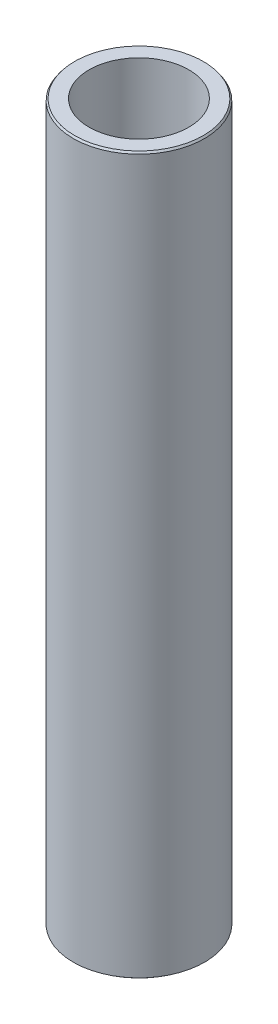
ISO-10303-21;
HEADER;
FILE_DESCRIPTION(('STEP AP214'),'2;1');
FILE_NAME('part.step','',(''),(''),'','','');
FILE_SCHEMA(('AUTOMOTIVE_DESIGN { 1 0 10303 214 1 1 1 1 }'));
ENDSEC;
DATA;
#1=APPLICATION_CONTEXT('core data for automotive mechanical design processes');
#2=APPLICATION_PROTOCOL_DEFINITION('international standard','automotive_design',2000,#1);
#3=PRODUCT_CONTEXT('',#1,'mechanical');
#4=PRODUCT('Part','Part','',(#3));
#5=PRODUCT_RELATED_PRODUCT_CATEGORY('part','',(#4));
#6=PRODUCT_DEFINITION_FORMATION('','',#4);
#7=PRODUCT_DEFINITION_CONTEXT('part definition',#1,'design');
#8=PRODUCT_DEFINITION('design','',#6,#7);
#9=PRODUCT_DEFINITION_SHAPE('','',#8);
#10=(LENGTH_UNIT() NAMED_UNIT(*) SI_UNIT(.MILLI.,.METRE.));
#11=(NAMED_UNIT(*) PLANE_ANGLE_UNIT() SI_UNIT($,.RADIAN.));
#12=(NAMED_UNIT(*) SI_UNIT($,.STERADIAN.) SOLID_ANGLE_UNIT());
#13=UNCERTAINTY_MEASURE_WITH_UNIT(LENGTH_MEASURE(1.E-05),#10,'distance_accuracy_value','');
#14=(GEOMETRIC_REPRESENTATION_CONTEXT(3) GLOBAL_UNCERTAINTY_ASSIGNED_CONTEXT((#13)) GLOBAL_UNIT_ASSIGNED_CONTEXT((#10,
#11,#12)) REPRESENTATION_CONTEXT('',''));
#15=CARTESIAN_POINT('',(0.,0.,0.));
#16=DIRECTION('',(0.,0.,1.));
#17=DIRECTION('',(1.,0.,0.));
#18=AXIS2_PLACEMENT_3D('',#15,#16,#17);
#19=CARTESIAN_POINT('',(0.,600.,0.));
#20=DIRECTION('',(0.,-1.,0.));
#21=DIRECTION('',(0.,0.,-1.));
#22=AXIS2_PLACEMENT_3D('',#19,#20,#21);
#23=CYLINDRICAL_SURFACE('',#22,55.);
#24=CARTESIAN_POINT('',(0.,598.47174187219,0.));
#25=DIRECTION('',(0.,1.,0.));
#26=DIRECTION('',(0.,0.,1.));
#27=AXIS2_PLACEMENT_3D('',#24,#25,#26);
#28=CIRCLE('',#27,55.);
#29=CARTESIAN_POINT('',(0.,598.47174187219,55.));
#30=VERTEX_POINT('',#29);
#31=EDGE_CURVE('E50',#30,#30,#28,.F.);
#32=ORIENTED_EDGE('',*,*,#31,.T.);
#33=EDGE_LOOP('',(#32));
#34=FACE_BOUND('',#33,.T.);
#35=CARTESIAN_POINT('',(0.,1.15734038939996,0.));
#36=DIRECTION('',(0.,1.,0.));
#37=DIRECTION('',(0.,0.,1.));
#38=AXIS2_PLACEMENT_3D('',#35,#36,#37);
#39=CIRCLE('',#38,55.);
#40=CARTESIAN_POINT('',(0.,1.15734038939996,55.));
#41=VERTEX_POINT('',#40);
#42=EDGE_CURVE('E51',#41,#41,#39,.T.);
#43=ORIENTED_EDGE('',*,*,#42,.T.);
#44=EDGE_LOOP('',(#43));
#45=FACE_BOUND('',#44,.T.);
#46=ADVANCED_FACE('F39',(#34,#45),#23,.T.);
#47=CARTESIAN_POINT('',(0.,600.,0.));
#48=DIRECTION('',(0.,1.,0.));
#49=DIRECTION('',(0.,0.,1.));
#50=AXIS2_PLACEMENT_3D('',#47,#48,#49);
#51=PLANE('',#50);
#52=CARTESIAN_POINT('',(0.,600.,0.));
#53=DIRECTION('',(0.,1.,0.));
#54=DIRECTION('',(0.,0.,1.));
#55=AXIS2_PLACEMENT_3D('',#52,#53,#54);
#56=CIRCLE('',#55,53.8426596106001);
#57=CARTESIAN_POINT('',(0.,600.,53.8426596106001));
#58=VERTEX_POINT('',#57);
#59=EDGE_CURVE('E54',#58,#58,#56,.T.);
#60=ORIENTED_EDGE('',*,*,#59,.T.);
#61=EDGE_LOOP('',(#60));
#62=FACE_BOUND('',#61,.T.);
#63=CARTESIAN_POINT('',(0.,600.,0.));
#64=DIRECTION('',(0.,1.,0.));
#65=DIRECTION('',(0.,0.,1.));
#66=AXIS2_PLACEMENT_3D('',#63,#64,#65);
#67=CIRCLE('',#66,41.7441951928502);
#68=CARTESIAN_POINT('',(0.,600.,41.7441951928502));
#69=VERTEX_POINT('',#68);
#70=EDGE_CURVE('E58',#69,#69,#67,.T.);
#71=ORIENTED_EDGE('',*,*,#70,.F.);
#72=EDGE_LOOP('',(#71));
#73=FACE_BOUND('',#72,.T.);
#74=ADVANCED_FACE('F69',(#62,#73),#51,.T.);
#75=CARTESIAN_POINT('',(0.,0.,0.));
#76=DIRECTION('',(0.,1.,0.));
#77=DIRECTION('',(0.,0.,1.));
#78=AXIS2_PLACEMENT_3D('',#75,#76,#77);
#79=PLANE('',#78);
#80=CARTESIAN_POINT('',(0.,0.,0.));
#81=DIRECTION('',(0.,1.,0.));
#82=DIRECTION('',(0.,0.,1.));
#83=AXIS2_PLACEMENT_3D('',#80,#81,#82);
#84=CIRCLE('',#83,53.4717418721897);
#85=CARTESIAN_POINT('',(0.,0.,53.4717418721897));
#86=VERTEX_POINT('',#85);
#87=EDGE_CURVE('E10',#86,#86,#84,.F.);
#88=ORIENTED_EDGE('',*,*,#87,.T.);
#89=EDGE_LOOP('',(#88));
#90=FACE_BOUND('',#89,.T.);
#91=CARTESIAN_POINT('',(0.,0.,0.));
#92=DIRECTION('',(0.,1.,0.));
#93=DIRECTION('',(0.,0.,1.));
#94=AXIS2_PLACEMENT_3D('',#91,#92,#93);
#95=CIRCLE('',#94,41.7441951928502);
#96=CARTESIAN_POINT('',(0.,0.,41.7441951928502));
#97=VERTEX_POINT('',#96);
#98=EDGE_CURVE('E63',#97,#97,#95,.T.);
#99=ORIENTED_EDGE('',*,*,#98,.T.);
#100=EDGE_LOOP('',(#99));
#101=FACE_BOUND('',#100,.T.);
#102=ADVANCED_FACE('F75',(#90,#101),#79,.F.);
#103=CARTESIAN_POINT('',(0.,600.,0.));
#104=DIRECTION('',(0.,-1.,0.));
#105=DIRECTION('',(0.,0.,-1.));
#106=AXIS2_PLACEMENT_3D('',#103,#104,#105);
#107=CYLINDRICAL_SURFACE('',#106,41.7441951928502);
#108=ORIENTED_EDGE('',*,*,#70,.T.);
#109=EDGE_LOOP('',(#108));
#110=FACE_BOUND('',#109,.T.);
#111=ORIENTED_EDGE('',*,*,#98,.F.);
#112=EDGE_LOOP('',(#111));
#113=FACE_BOUND('',#112,.T.);
#114=ADVANCED_FACE('F70',(#110,#113),#107,.F.);
#115=CARTESIAN_POINT('',(0.,600.,0.));
#116=DIRECTION('',(0.,-1.,0.));
#117=DIRECTION('',(0.,0.,-1.));
#118=AXIS2_PLACEMENT_3D('',#115,#116,#117);
#119=CONICAL_SURFACE('',#118,53.8426596106001,0.648152814882941);
#120=ORIENTED_EDGE('',*,*,#31,.F.);
#121=EDGE_LOOP('',(#120));
#122=FACE_BOUND('',#121,.T.);
#123=ORIENTED_EDGE('',*,*,#59,.F.);
#124=EDGE_LOOP('',(#123));
#125=FACE_BOUND('',#124,.T.);
#126=ADVANCED_FACE('F81',(#122,#125),#119,.T.);
#127=CARTESIAN_POINT('',(0.,1.15734038939996,0.));
#128=DIRECTION('',(0.,1.,0.));
#129=DIRECTION('',(0.,0.,1.));
#130=AXIS2_PLACEMENT_3D('',#127,#128,#129);
#131=CONICAL_SURFACE('',#130,55.,0.922643511911923);
#132=CARTESIAN_POINT('',(0.,0.,53.4717418721897));
#133=CARTESIAN_POINT('',(0.,0.0120556290562486,53.4876612276878));
#134=CARTESIAN_POINT('',(0.,0.0241112581124986,53.5035805831858));
#135=CARTESIAN_POINT('',(0.,0.0482225162249986,53.5354192941818));
#136=CARTESIAN_POINT('',(0.,0.0602781452812486,53.5513386496798));
#137=CARTESIAN_POINT('',(0.,0.0843894033937475,53.5831773606759));
#138=CARTESIAN_POINT('',(0.,0.0964450324499964,53.5990967161739));
#139=CARTESIAN_POINT('',(0.,0.120556290562495,53.63093542717));
#140=CARTESIAN_POINT('',(0.,0.132611919618745,53.646854782668));
#141=CARTESIAN_POINT('',(0.,0.156723177731245,53.678693493664));
#142=CARTESIAN_POINT('',(0.,0.168778806787495,53.6946128491621));
#143=CARTESIAN_POINT('',(0.,0.192890064899994,53.7264515601581));
#144=CARTESIAN_POINT('',(0.,0.204945693956243,53.7423709156561));
#145=CARTESIAN_POINT('',(0.,0.229056952068742,53.7742096266522));
#146=CARTESIAN_POINT('',(0.,0.241112581124992,53.7901289821502));
#147=CARTESIAN_POINT('',(0.,0.265223839237491,53.8219676931462));
#148=CARTESIAN_POINT('',(0.,0.277279468293741,53.8378870486443));
#149=CARTESIAN_POINT('',(0.,0.30139072640624,53.8697257596403));
#150=CARTESIAN_POINT('',(0.,0.31344635546249,53.8856451151383));
#151=CARTESIAN_POINT('',(0.,0.337557613574989,53.9174838261344));
#152=CARTESIAN_POINT('',(0.,0.349613242631238,53.9334031816324));
#153=CARTESIAN_POINT('',(0.,0.373724500743737,53.9652418926285));
#154=CARTESIAN_POINT('',(0.,0.385780129799987,53.9811612481265));
#155=CARTESIAN_POINT('',(0.,0.409891387912487,54.0129999591225));
#156=CARTESIAN_POINT('',(0.,0.421947016968737,54.0289193146206));
#157=CARTESIAN_POINT('',(0.,0.446058275081236,54.0607580256166));
#158=CARTESIAN_POINT('',(0.,0.458113904137485,54.0766773811146));
#159=CARTESIAN_POINT('',(0.,0.482225162249984,54.1085160921107));
#160=CARTESIAN_POINT('',(0.,0.494280791306234,54.1244354476087));
#161=CARTESIAN_POINT('',(0.,0.518392049418734,54.1562741586047));
#162=CARTESIAN_POINT('',(0.,0.530447678474983,54.1721935141028));
#163=CARTESIAN_POINT('',(0.,0.554558936587482,54.2040322250988));
#164=CARTESIAN_POINT('',(0.,0.566614565643733,54.2199515805968));
#165=CARTESIAN_POINT('',(0.,0.590725823756232,54.2517902915929));
#166=CARTESIAN_POINT('',(0.,0.60278145281248,54.2677096470909));
#167=CARTESIAN_POINT('',(0.,0.626892710924979,54.299548358087));
#168=CARTESIAN_POINT('',(0.,0.638948339981229,54.315467713585));
#169=CARTESIAN_POINT('',(0.,0.663059598093729,54.347306424581));
#170=CARTESIAN_POINT('',(0.,0.675115227149979,54.363225780079));
#171=CARTESIAN_POINT('',(0.,0.699226485262478,54.3950644910751));
#172=CARTESIAN_POINT('',(0.,0.711282114318727,54.4109838465731));
#173=CARTESIAN_POINT('',(0.,0.735393372431226,54.4428225575692));
#174=CARTESIAN_POINT('',(0.,0.747449001487476,54.4587419130672));
#175=CARTESIAN_POINT('',(0.,0.771560259599976,54.4905806240632));
#176=CARTESIAN_POINT('',(0.,0.783615888656225,54.5064999795613));
#177=CARTESIAN_POINT('',(0.,0.807727146768724,54.5383386905573));
#178=CARTESIAN_POINT('',(0.,0.819782775824975,54.5542580460553));
#179=CARTESIAN_POINT('',(0.,0.843894033937474,54.5860967570514));
#180=CARTESIAN_POINT('',(0.,0.855949662993722,54.6020161125494));
#181=CARTESIAN_POINT('',(0.,0.880060921106221,54.6338548235455));
#182=CARTESIAN_POINT('',(0.,0.892116550162471,54.6497741790435));
#183=CARTESIAN_POINT('',(0.,0.916227808274971,54.6816128900395));
#184=CARTESIAN_POINT('',(0.,0.928283437331221,54.6975322455376));
#185=CARTESIAN_POINT('',(0.,0.95239469544372,54.7293709565336));
#186=CARTESIAN_POINT('',(0.,0.964450324499969,54.7452903120316));
#187=CARTESIAN_POINT('',(0.,0.988561582612468,54.7771290230277));
#188=CARTESIAN_POINT('',(0.,1.00061721166872,54.7930483785257));
#189=CARTESIAN_POINT('',(0.,1.02472846978122,54.8248870895217));
#190=CARTESIAN_POINT('',(0.,1.03678409883747,54.8408064450198));
#191=CARTESIAN_POINT('',(0.,1.06089535694997,54.8726451560158));
#192=CARTESIAN_POINT('',(0.,1.07295098600622,54.8885645115138));
#193=CARTESIAN_POINT('',(0.,1.09706224411872,54.9204032225099));
#194=CARTESIAN_POINT('',(0.,1.10911787317496,54.9363225780079));
#195=CARTESIAN_POINT('',(0.,1.13322913128746,54.968161289004));
#196=CARTESIAN_POINT('',(0.,1.14528476034371,54.984080644502));
#197=CARTESIAN_POINT('',(0.,1.15734038939996,55.));
#198=B_SPLINE_CURVE_WITH_KNOTS('',3,(#132,#133,#134,#135,#136,#137,#138,#139,#140,#141,#142,
#143,#144,#145,#146,#147,#148,#149,#150,#151,#152,#153,#154,#155,#156,#157,#158,#159,#160,#161,
#162,#163,#164,#165,#166,#167,#168,#169,#170,#171,#172,#173,#174,#175,#176,#177,#178,#179,#180,
#181,#182,#183,#184,#185,#186,#187,#188,#189,#190,#191,#192,#193,#194,#195,#196,#197),
.UNSPECIFIED.,.F.,.F.,(4,2,2,2,2,2,2,2,2,2,2,2,2,2,2,2,2,2,2,2,2,2,2,2,2,2,2,2,2,2,2,2,4),(0.,
0.0599072336427659,0.119814467285532,0.179721700928303,0.239628934571069,0.299536168213835,
0.359443401856606,0.419350635499372,0.479257869142138,0.539165102784904,0.599072336427675,
0.658979570070441,0.718886803713207,0.778794037355978,0.838701270998744,0.89860850464151,
0.958515738284276,1.01842297192705,1.07833020556981,1.13823743921258,1.19814467285535,
1.25805190649812,1.31795914014088,1.37786637378365,1.43777360742642,1.49768084106918,
1.55758807471195,1.61749530835472,1.67740254199749,1.73730977564025,1.79721700928302,
1.85712424292579,1.91703147656856),.UNSPECIFIED.);
#199=EDGE_CURVE('BSEAM45',#86,#41,#198,.T.);
#200=ORIENTED_EDGE('',*,*,#87,.F.);
#201=ORIENTED_EDGE('',*,*,#42,.F.);
#202=ORIENTED_EDGE('',*,*,#199,.T.);
#203=ORIENTED_EDGE('',*,*,#199,.F.);
#204=EDGE_LOOP('',(#200,#202,#201,#203));
#205=FACE_BOUND('',#204,.T.);
#206=ADVANCED_FACE('F45',(#205),#131,.T.);
#207=CLOSED_SHELL('',(#46,#74,#102,#114,#126,#206));
#208=MANIFOLD_SOLID_BREP('B2',#207);
#209=ADVANCED_BREP_SHAPE_REPRESENTATION('',(#18,#208),#14);
#210=SHAPE_DEFINITION_REPRESENTATION(#9,#209);
ENDSEC;
END-ISO-10303-21;
